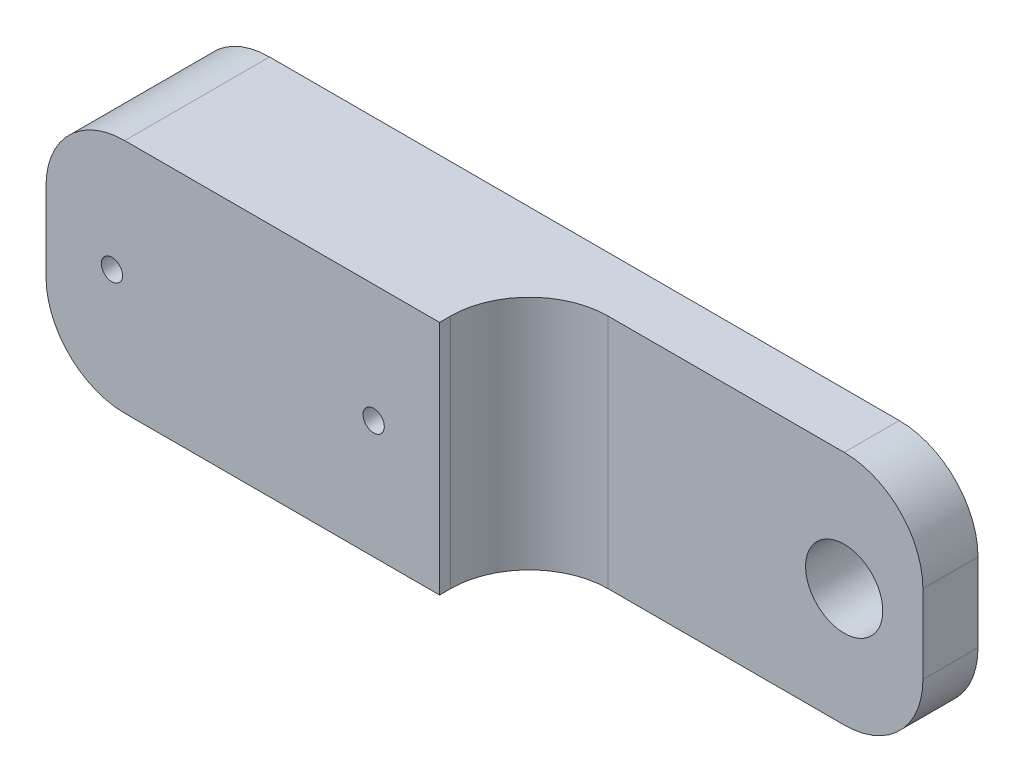
ISO-10303-21;
HEADER;
FILE_DESCRIPTION(('STEP AP214'),'2;1');
FILE_NAME('part.step','',(''),(''),'','','');
FILE_SCHEMA(('AUTOMOTIVE_DESIGN { 1 0 10303 214 1 1 1 1 }'));
ENDSEC;
DATA;
#1=APPLICATION_CONTEXT('core data for automotive mechanical design processes');
#2=APPLICATION_PROTOCOL_DEFINITION('international standard','automotive_design',2000,#1);
#3=PRODUCT_CONTEXT('',#1,'mechanical');
#4=PRODUCT('Part','Part','',(#3));
#5=PRODUCT_RELATED_PRODUCT_CATEGORY('part','',(#4));
#6=PRODUCT_DEFINITION_FORMATION('','',#4);
#7=PRODUCT_DEFINITION_CONTEXT('part definition',#1,'design');
#8=PRODUCT_DEFINITION('design','',#6,#7);
#9=PRODUCT_DEFINITION_SHAPE('','',#8);
#10=(LENGTH_UNIT() NAMED_UNIT(*) SI_UNIT(.MILLI.,.METRE.));
#11=(NAMED_UNIT(*) PLANE_ANGLE_UNIT() SI_UNIT($,.RADIAN.));
#12=(NAMED_UNIT(*) SI_UNIT($,.STERADIAN.) SOLID_ANGLE_UNIT());
#13=UNCERTAINTY_MEASURE_WITH_UNIT(LENGTH_MEASURE(1.E-05),#10,'distance_accuracy_value','');
#14=(GEOMETRIC_REPRESENTATION_CONTEXT(3) GLOBAL_UNCERTAINTY_ASSIGNED_CONTEXT((#13)) GLOBAL_UNIT_ASSIGNED_CONTEXT((#10,
#11,#12)) REPRESENTATION_CONTEXT('',''));
#15=CARTESIAN_POINT('',(0.,0.,0.));
#16=DIRECTION('',(0.,0.,1.));
#17=DIRECTION('',(1.,0.,0.));
#18=AXIS2_PLACEMENT_3D('',#15,#16,#17);
#19=CARTESIAN_POINT('',(0.,30.,18.4));
#20=DIRECTION('',(0.,1.,0.));
#21=DIRECTION('',(0.,0.,1.));
#22=AXIS2_PLACEMENT_3D('',#19,#20,#21);
#23=PLANE('',#22);
#24=DIRECTION('',(1.,0.,0.));
#25=VECTOR('',#24,1.);
#26=CARTESIAN_POINT('',(0.,30.,0.));
#27=LINE('',#26,#25);
#28=CARTESIAN_POINT('',(10.,30.,0.));
#29=VERTEX_POINT('',#28);
#30=CARTESIAN_POINT('',(90.,30.,0.));
#31=VERTEX_POINT('',#30);
#32=EDGE_CURVE('E154',#29,#31,#27,.T.);
#33=ORIENTED_EDGE('',*,*,#32,.F.);
#34=DIRECTION('',(0.,0.,-1.));
#35=VECTOR('',#34,1.);
#36=CARTESIAN_POINT('',(10.,30.,18.4));
#37=LINE('',#36,#35);
#38=CARTESIAN_POINT('',(10.,30.,18.4));
#39=VERTEX_POINT('',#38);
#40=EDGE_CURVE('E188',#29,#39,#37,.F.);
#41=ORIENTED_EDGE('',*,*,#40,.T.);
#42=DIRECTION('',(1.,0.,0.));
#43=VECTOR('',#42,1.);
#44=CARTESIAN_POINT('',(0.,30.,18.4));
#45=LINE('',#44,#43);
#46=CARTESIAN_POINT('',(50.,30.,18.4));
#47=VERTEX_POINT('',#46);
#48=EDGE_CURVE('E163',#39,#47,#45,.T.);
#49=ORIENTED_EDGE('',*,*,#48,.T.);
#50=DIRECTION('',(0.,0.,-1.));
#51=VECTOR('',#50,1.);
#52=CARTESIAN_POINT('',(50.,30.,18.4));
#53=LINE('',#52,#51);
#54=CARTESIAN_POINT('',(50.,30.,17.));
#55=VERTEX_POINT('',#54);
#56=EDGE_CURVE('E146',#47,#55,#53,.T.);
#57=ORIENTED_EDGE('',*,*,#56,.T.);
#58=CARTESIAN_POINT('',(60.,30.,17.));
#59=DIRECTION('',(0.,1.,0.));
#60=DIRECTION('',(0.,0.,1.));
#61=AXIS2_PLACEMENT_3D('',#58,#59,#60);
#62=CIRCLE('',#61,10.);
#63=CARTESIAN_POINT('',(60.,30.,7.));
#64=VERTEX_POINT('',#63);
#65=EDGE_CURVE('E46',#55,#64,#62,.F.);
#66=ORIENTED_EDGE('',*,*,#65,.T.);
#67=DIRECTION('',(1.,0.,0.));
#68=VECTOR('',#67,1.);
#69=CARTESIAN_POINT('',(0.,30.,7.));
#70=LINE('',#69,#68);
#71=CARTESIAN_POINT('',(90.,30.,7.));
#72=VERTEX_POINT('',#71);
#73=EDGE_CURVE('E158',#64,#72,#70,.T.);
#74=ORIENTED_EDGE('',*,*,#73,.T.);
#75=DIRECTION('',(0.,0.,-1.));
#76=VECTOR('',#75,1.);
#77=CARTESIAN_POINT('',(90.,30.,0.));
#78=LINE('',#77,#76);
#79=EDGE_CURVE('E185',#72,#31,#78,.T.);
#80=ORIENTED_EDGE('',*,*,#79,.T.);
#81=EDGE_LOOP('',(#33,#41,#49,#57,#66,#74,#80));
#82=FACE_BOUND('',#81,.T.);
#83=ADVANCED_FACE('F38',(#82),#23,.T.);
#84=CARTESIAN_POINT('',(0.,0.,18.4));
#85=DIRECTION('',(-1.,0.,0.));
#86=DIRECTION('',(0.,0.,1.));
#87=AXIS2_PLACEMENT_3D('',#84,#85,#86);
#88=PLANE('',#87);
#89=DIRECTION('',(0.,1.,0.));
#90=VECTOR('',#89,1.);
#91=CARTESIAN_POINT('',(0.,0.,18.4));
#92=LINE('',#91,#90);
#93=CARTESIAN_POINT('',(0.,10.,18.4));
#94=VERTEX_POINT('',#93);
#95=CARTESIAN_POINT('',(0.,20.,18.4));
#96=VERTEX_POINT('',#95);
#97=EDGE_CURVE('E135',#94,#96,#92,.T.);
#98=ORIENTED_EDGE('',*,*,#97,.T.);
#99=DIRECTION('',(0.,0.,-1.));
#100=VECTOR('',#99,1.);
#101=CARTESIAN_POINT('',(0.,20.,18.4));
#102=LINE('',#101,#100);
#103=CARTESIAN_POINT('',(0.,20.,0.));
#104=VERTEX_POINT('',#103);
#105=EDGE_CURVE('E174',#96,#104,#102,.T.);
#106=ORIENTED_EDGE('',*,*,#105,.T.);
#107=DIRECTION('',(0.,1.,0.));
#108=VECTOR('',#107,1.);
#109=CARTESIAN_POINT('',(0.,0.,0.));
#110=LINE('',#109,#108);
#111=CARTESIAN_POINT('',(0.,10.,0.));
#112=VERTEX_POINT('',#111);
#113=EDGE_CURVE('E157',#112,#104,#110,.T.);
#114=ORIENTED_EDGE('',*,*,#113,.F.);
#115=DIRECTION('',(0.,0.,-1.));
#116=VECTOR('',#115,1.);
#117=CARTESIAN_POINT('',(0.,10.,18.4));
#118=LINE('',#117,#116);
#119=EDGE_CURVE('E145',#112,#94,#118,.F.);
#120=ORIENTED_EDGE('',*,*,#119,.T.);
#121=EDGE_LOOP('',(#98,#106,#114,#120));
#122=FACE_BOUND('',#121,.T.);
#123=ADVANCED_FACE('F226',(#122),#88,.T.);
#124=CARTESIAN_POINT('',(0.,0.,18.4));
#125=DIRECTION('',(0.,1.,0.));
#126=DIRECTION('',(0.,0.,1.));
#127=AXIS2_PLACEMENT_3D('',#124,#125,#126);
#128=PLANE('',#127);
#129=DIRECTION('',(1.,0.,0.));
#130=VECTOR('',#129,1.);
#131=CARTESIAN_POINT('',(0.,0.,18.4));
#132=LINE('',#131,#130);
#133=CARTESIAN_POINT('',(10.,0.,18.4));
#134=VERTEX_POINT('',#133);
#135=CARTESIAN_POINT('',(50.,0.,18.4));
#136=VERTEX_POINT('',#135);
#137=EDGE_CURVE('E122',#134,#136,#132,.T.);
#138=ORIENTED_EDGE('',*,*,#137,.F.);
#139=DIRECTION('',(0.,0.,-1.));
#140=VECTOR('',#139,1.);
#141=CARTESIAN_POINT('',(10.,0.,0.));
#142=LINE('',#141,#140);
#143=CARTESIAN_POINT('',(10.,0.,0.));
#144=VERTEX_POINT('',#143);
#145=EDGE_CURVE('E195',#134,#144,#142,.T.);
#146=ORIENTED_EDGE('',*,*,#145,.T.);
#147=DIRECTION('',(1.,0.,0.));
#148=VECTOR('',#147,1.);
#149=CARTESIAN_POINT('',(0.,0.,0.));
#150=LINE('',#149,#148);
#151=CARTESIAN_POINT('',(90.,0.,0.));
#152=VERTEX_POINT('',#151);
#153=EDGE_CURVE('E161',#144,#152,#150,.T.);
#154=ORIENTED_EDGE('',*,*,#153,.T.);
#155=DIRECTION('',(0.,0.,-1.));
#156=VECTOR('',#155,1.);
#157=CARTESIAN_POINT('',(90.,0.,18.4));
#158=LINE('',#157,#156);
#159=CARTESIAN_POINT('',(90.,0.,7.));
#160=VERTEX_POINT('',#159);
#161=EDGE_CURVE('E193',#152,#160,#158,.F.);
#162=ORIENTED_EDGE('',*,*,#161,.T.);
#163=DIRECTION('',(1.,0.,0.));
#164=VECTOR('',#163,1.);
#165=CARTESIAN_POINT('',(0.,0.,7.));
#166=LINE('',#165,#164);
#167=CARTESIAN_POINT('',(60.,0.,7.));
#168=VERTEX_POINT('',#167);
#169=EDGE_CURVE('E266',#168,#160,#166,.T.);
#170=ORIENTED_EDGE('',*,*,#169,.F.);
#171=CARTESIAN_POINT('',(60.,0.,17.));
#172=DIRECTION('',(0.,1.,0.));
#173=DIRECTION('',(0.,0.,1.));
#174=AXIS2_PLACEMENT_3D('',#171,#172,#173);
#175=CIRCLE('',#174,10.);
#176=CARTESIAN_POINT('',(50.,0.,17.));
#177=VERTEX_POINT('',#176);
#178=EDGE_CURVE('E11',#168,#177,#175,.T.);
#179=ORIENTED_EDGE('',*,*,#178,.T.);
#180=DIRECTION('',(0.,0.,-1.));
#181=VECTOR('',#180,1.);
#182=CARTESIAN_POINT('',(50.,0.,18.4));
#183=LINE('',#182,#181);
#184=EDGE_CURVE('E138',#136,#177,#183,.T.);
#185=ORIENTED_EDGE('',*,*,#184,.F.);
#186=EDGE_LOOP('',(#138,#146,#154,#162,#170,#179,#185));
#187=FACE_BOUND('',#186,.T.);
#188=ADVANCED_FACE('F139',(#187),#128,.F.);
#189=CARTESIAN_POINT('',(50.,0.,18.4));
#190=DIRECTION('',(-1.,0.,0.));
#191=DIRECTION('',(0.,0.,1.));
#192=AXIS2_PLACEMENT_3D('',#189,#190,#191);
#193=PLANE('',#192);
#194=ORIENTED_EDGE('',*,*,#184,.T.);
#195=DIRECTION('',(0.,1.,0.));
#196=VECTOR('',#195,1.);
#197=CARTESIAN_POINT('',(50.,0.,17.));
#198=LINE('',#197,#196);
#199=EDGE_CURVE('E206',#177,#55,#198,.T.);
#200=ORIENTED_EDGE('',*,*,#199,.T.);
#201=ORIENTED_EDGE('',*,*,#56,.F.);
#202=DIRECTION('',(0.,1.,0.));
#203=VECTOR('',#202,1.);
#204=CARTESIAN_POINT('',(50.,0.,18.4));
#205=LINE('',#204,#203);
#206=EDGE_CURVE('E127',#136,#47,#205,.T.);
#207=ORIENTED_EDGE('',*,*,#206,.F.);
#208=EDGE_LOOP('',(#194,#200,#201,#207));
#209=FACE_BOUND('',#208,.T.);
#210=ADVANCED_FACE('F148',(#209),#193,.F.);
#211=CARTESIAN_POINT('',(0.,0.,18.4));
#212=DIRECTION('',(0.,0.,1.));
#213=DIRECTION('',(1.,0.,0.));
#214=AXIS2_PLACEMENT_3D('',#211,#212,#213);
#215=PLANE('',#214);
#216=CARTESIAN_POINT('',(8.375,15.,18.4));
#217=DIRECTION('',(0.,0.,1.));
#218=DIRECTION('',(1.,0.,0.));
#219=AXIS2_PLACEMENT_3D('',#216,#217,#218);
#220=CIRCLE('',#219,1.35);
#221=CARTESIAN_POINT('',(9.725,15.,18.4));
#222=VERTEX_POINT('',#221);
#223=EDGE_CURVE('E169',#222,#222,#220,.T.);
#224=ORIENTED_EDGE('',*,*,#223,.F.);
#225=EDGE_LOOP('',(#224));
#226=FACE_BOUND('',#225,.T.);
#227=CARTESIAN_POINT('',(41.625,15.,18.4));
#228=DIRECTION('',(0.,0.,1.));
#229=DIRECTION('',(1.,0.,0.));
#230=AXIS2_PLACEMENT_3D('',#227,#228,#229);
#231=CIRCLE('',#230,1.35);
#232=CARTESIAN_POINT('',(42.975,15.,18.4));
#233=VERTEX_POINT('',#232);
#234=EDGE_CURVE('E270',#233,#233,#231,.T.);
#235=ORIENTED_EDGE('',*,*,#234,.F.);
#236=EDGE_LOOP('',(#235));
#237=FACE_BOUND('',#236,.T.);
#238=ORIENTED_EDGE('',*,*,#48,.F.);
#239=CARTESIAN_POINT('',(10.,20.,18.4));
#240=DIRECTION('',(0.,0.,1.));
#241=DIRECTION('',(1.,0.,0.));
#242=AXIS2_PLACEMENT_3D('',#239,#240,#241);
#243=CIRCLE('',#242,10.);
#244=EDGE_CURVE('E191',#39,#96,#243,.T.);
#245=ORIENTED_EDGE('',*,*,#244,.T.);
#246=ORIENTED_EDGE('',*,*,#97,.F.);
#247=CARTESIAN_POINT('',(10.,10.,18.4));
#248=DIRECTION('',(0.,0.,1.));
#249=DIRECTION('',(1.,0.,0.));
#250=AXIS2_PLACEMENT_3D('',#247,#248,#249);
#251=CIRCLE('',#250,10.);
#252=EDGE_CURVE('E131',#94,#134,#251,.T.);
#253=ORIENTED_EDGE('',*,*,#252,.T.);
#254=ORIENTED_EDGE('',*,*,#137,.T.);
#255=ORIENTED_EDGE('',*,*,#206,.T.);
#256=EDGE_LOOP('',(#238,#245,#246,#253,#254,#255));
#257=FACE_BOUND('',#256,.T.);
#258=ADVANCED_FACE('F125',(#226,#237,#257),#215,.T.);
#259=CARTESIAN_POINT('',(0.,0.,0.));
#260=DIRECTION('',(0.,0.,1.));
#261=DIRECTION('',(1.,0.,0.));
#262=AXIS2_PLACEMENT_3D('',#259,#260,#261);
#263=PLANE('',#262);
#264=CARTESIAN_POINT('',(8.375,15.,0.));
#265=DIRECTION('',(0.,0.,1.));
#266=DIRECTION('',(1.,0.,0.));
#267=AXIS2_PLACEMENT_3D('',#264,#265,#266);
#268=CIRCLE('',#267,1.35);
#269=CARTESIAN_POINT('',(9.725,15.,0.));
#270=VERTEX_POINT('',#269);
#271=EDGE_CURVE('E168',#270,#270,#268,.T.);
#272=ORIENTED_EDGE('',*,*,#271,.T.);
#273=EDGE_LOOP('',(#272));
#274=FACE_BOUND('',#273,.T.);
#275=CARTESIAN_POINT('',(41.625,15.,0.));
#276=DIRECTION('',(0.,0.,1.));
#277=DIRECTION('',(1.,0.,0.));
#278=AXIS2_PLACEMENT_3D('',#275,#276,#277);
#279=CIRCLE('',#278,1.35);
#280=CARTESIAN_POINT('',(42.975,15.,0.));
#281=VERTEX_POINT('',#280);
#282=EDGE_CURVE('E165',#281,#281,#279,.T.);
#283=ORIENTED_EDGE('',*,*,#282,.T.);
#284=EDGE_LOOP('',(#283));
#285=FACE_BOUND('',#284,.T.);
#286=ORIENTED_EDGE('',*,*,#113,.T.);
#287=CARTESIAN_POINT('',(10.,20.,0.));
#288=DIRECTION('',(0.,0.,1.));
#289=DIRECTION('',(1.,0.,0.));
#290=AXIS2_PLACEMENT_3D('',#287,#288,#289);
#291=CIRCLE('',#290,10.);
#292=EDGE_CURVE('E183',#104,#29,#291,.F.);
#293=ORIENTED_EDGE('',*,*,#292,.T.);
#294=ORIENTED_EDGE('',*,*,#32,.T.);
#295=CARTESIAN_POINT('',(90.,20.,0.));
#296=DIRECTION('',(0.,0.,1.));
#297=DIRECTION('',(1.,0.,0.));
#298=AXIS2_PLACEMENT_3D('',#295,#296,#297);
#299=CIRCLE('',#298,10.);
#300=CARTESIAN_POINT('',(100.,20.,0.));
#301=VERTEX_POINT('',#300);
#302=EDGE_CURVE('E179',#31,#301,#299,.F.);
#303=ORIENTED_EDGE('',*,*,#302,.T.);
#304=DIRECTION('',(0.,1.,0.));
#305=VECTOR('',#304,1.);
#306=CARTESIAN_POINT('',(100.,0.,0.));
#307=LINE('',#306,#305);
#308=CARTESIAN_POINT('',(100.,10.,0.));
#309=VERTEX_POINT('',#308);
#310=EDGE_CURVE('E260',#309,#301,#307,.T.);
#311=ORIENTED_EDGE('',*,*,#310,.F.);
#312=CARTESIAN_POINT('',(90.,10.,0.));
#313=DIRECTION('',(0.,0.,1.));
#314=DIRECTION('',(1.,0.,0.));
#315=AXIS2_PLACEMENT_3D('',#312,#313,#314);
#316=CIRCLE('',#315,10.);
#317=EDGE_CURVE('E177',#309,#152,#316,.F.);
#318=ORIENTED_EDGE('',*,*,#317,.T.);
#319=ORIENTED_EDGE('',*,*,#153,.F.);
#320=CARTESIAN_POINT('',(10.,10.,0.));
#321=DIRECTION('',(0.,0.,1.));
#322=DIRECTION('',(1.,0.,0.));
#323=AXIS2_PLACEMENT_3D('',#320,#321,#322);
#324=CIRCLE('',#323,10.);
#325=EDGE_CURVE('E181',#144,#112,#324,.F.);
#326=ORIENTED_EDGE('',*,*,#325,.T.);
#327=EDGE_LOOP('',(#286,#293,#294,#303,#311,#318,#319,#326));
#328=FACE_BOUND('',#327,.T.);
#329=CARTESIAN_POINT('',(90.,15.,0.));
#330=DIRECTION('',(0.,0.,1.));
#331=DIRECTION('',(1.,0.,0.));
#332=AXIS2_PLACEMENT_3D('',#329,#330,#331);
#333=CIRCLE('',#332,4.9);
#334=CARTESIAN_POINT('',(94.9,15.,0.));
#335=VERTEX_POINT('',#334);
#336=EDGE_CURVE('E172',#335,#335,#333,.T.);
#337=ORIENTED_EDGE('',*,*,#336,.T.);
#338=EDGE_LOOP('',(#337));
#339=FACE_BOUND('',#338,.T.);
#340=ADVANCED_FACE('F250',(#274,#285,#328,#339),#263,.F.);
#341=CARTESIAN_POINT('',(100.,0.,7.));
#342=DIRECTION('',(-1.,0.,0.));
#343=DIRECTION('',(0.,0.,1.));
#344=AXIS2_PLACEMENT_3D('',#341,#342,#343);
#345=PLANE('',#344);
#346=ORIENTED_EDGE('',*,*,#310,.T.);
#347=DIRECTION('',(0.,0.,-1.));
#348=VECTOR('',#347,1.);
#349=CARTESIAN_POINT('',(100.,20.,7.));
#350=LINE('',#349,#348);
#351=CARTESIAN_POINT('',(100.,20.,7.));
#352=VERTEX_POINT('',#351);
#353=EDGE_CURVE('E53',#301,#352,#350,.F.);
#354=ORIENTED_EDGE('',*,*,#353,.T.);
#355=DIRECTION('',(0.,1.,0.));
#356=VECTOR('',#355,1.);
#357=CARTESIAN_POINT('',(100.,0.,7.));
#358=LINE('',#357,#356);
#359=CARTESIAN_POINT('',(100.,10.,7.));
#360=VERTEX_POINT('',#359);
#361=EDGE_CURVE('E216',#360,#352,#358,.T.);
#362=ORIENTED_EDGE('',*,*,#361,.F.);
#363=DIRECTION('',(0.,0.,-1.));
#364=VECTOR('',#363,1.);
#365=CARTESIAN_POINT('',(100.,10.,7.));
#366=LINE('',#365,#364);
#367=EDGE_CURVE('E197',#360,#309,#366,.T.);
#368=ORIENTED_EDGE('',*,*,#367,.T.);
#369=EDGE_LOOP('',(#346,#354,#362,#368));
#370=FACE_BOUND('',#369,.T.);
#371=ADVANCED_FACE('F290',(#370),#345,.F.);
#372=CARTESIAN_POINT('',(90.,15.,7.));
#373=DIRECTION('',(0.,0.,-1.));
#374=DIRECTION('',(-1.,0.,0.));
#375=AXIS2_PLACEMENT_3D('',#372,#373,#374);
#376=CYLINDRICAL_SURFACE('',#375,4.9);
#377=CARTESIAN_POINT('',(90.,15.,7.));
#378=DIRECTION('',(0.,0.,1.));
#379=DIRECTION('',(1.,0.,0.));
#380=AXIS2_PLACEMENT_3D('',#377,#378,#379);
#381=CIRCLE('',#380,4.9);
#382=CARTESIAN_POINT('',(94.9,15.,7.));
#383=VERTEX_POINT('',#382);
#384=EDGE_CURVE('E262',#383,#383,#381,.T.);
#385=ORIENTED_EDGE('',*,*,#384,.T.);
#386=EDGE_LOOP('',(#385));
#387=FACE_BOUND('',#386,.T.);
#388=ORIENTED_EDGE('',*,*,#336,.F.);
#389=EDGE_LOOP('',(#388));
#390=FACE_BOUND('',#389,.T.);
#391=ADVANCED_FACE('F296',(#387,#390),#376,.F.);
#392=CARTESIAN_POINT('',(0.,0.,7.));
#393=DIRECTION('',(0.,0.,1.));
#394=DIRECTION('',(1.,0.,0.));
#395=AXIS2_PLACEMENT_3D('',#392,#393,#394);
#396=PLANE('',#395);
#397=ORIENTED_EDGE('',*,*,#384,.F.);
#398=EDGE_LOOP('',(#397));
#399=FACE_BOUND('',#398,.T.);
#400=ORIENTED_EDGE('',*,*,#361,.T.);
#401=CARTESIAN_POINT('',(90.,20.,7.));
#402=DIRECTION('',(0.,0.,1.));
#403=DIRECTION('',(1.,0.,0.));
#404=AXIS2_PLACEMENT_3D('',#401,#402,#403);
#405=CIRCLE('',#404,10.);
#406=EDGE_CURVE('E204',#352,#72,#405,.T.);
#407=ORIENTED_EDGE('',*,*,#406,.T.);
#408=ORIENTED_EDGE('',*,*,#73,.F.);
#409=DIRECTION('',(0.,1.,0.));
#410=VECTOR('',#409,1.);
#411=CARTESIAN_POINT('',(60.,0.,7.));
#412=LINE('',#411,#410);
#413=EDGE_CURVE('E201',#64,#168,#412,.F.);
#414=ORIENTED_EDGE('',*,*,#413,.T.);
#415=ORIENTED_EDGE('',*,*,#169,.T.);
#416=CARTESIAN_POINT('',(90.,10.,7.));
#417=DIRECTION('',(0.,0.,1.));
#418=DIRECTION('',(1.,0.,0.));
#419=AXIS2_PLACEMENT_3D('',#416,#417,#418);
#420=CIRCLE('',#419,10.);
#421=EDGE_CURVE('E60',#160,#360,#420,.T.);
#422=ORIENTED_EDGE('',*,*,#421,.T.);
#423=EDGE_LOOP('',(#400,#407,#408,#414,#415,#422));
#424=FACE_BOUND('',#423,.T.);
#425=ADVANCED_FACE('F214',(#399,#424),#396,.T.);
#426=CARTESIAN_POINT('',(41.625,15.,-8.6));
#427=DIRECTION('',(0.,0.,1.));
#428=DIRECTION('',(1.,0.,0.));
#429=AXIS2_PLACEMENT_3D('',#426,#427,#428);
#430=CYLINDRICAL_SURFACE('',#429,1.35);
#431=ORIENTED_EDGE('',*,*,#234,.T.);
#432=EDGE_LOOP('',(#431));
#433=FACE_BOUND('',#432,.T.);
#434=ORIENTED_EDGE('',*,*,#282,.F.);
#435=EDGE_LOOP('',(#434));
#436=FACE_BOUND('',#435,.T.);
#437=ADVANCED_FACE('F283',(#433,#436),#430,.F.);
#438=CARTESIAN_POINT('',(8.375,15.,-8.6));
#439=DIRECTION('',(0.,0.,1.));
#440=DIRECTION('',(1.,0.,0.));
#441=AXIS2_PLACEMENT_3D('',#438,#439,#440);
#442=CYLINDRICAL_SURFACE('',#441,1.35);
#443=ORIENTED_EDGE('',*,*,#223,.T.);
#444=EDGE_LOOP('',(#443));
#445=FACE_BOUND('',#444,.T.);
#446=ORIENTED_EDGE('',*,*,#271,.F.);
#447=EDGE_LOOP('',(#446));
#448=FACE_BOUND('',#447,.T.);
#449=ADVANCED_FACE('F239',(#445,#448),#442,.F.);
#450=CARTESIAN_POINT('',(10.,20.,18.4));
#451=DIRECTION('',(0.,0.,-1.));
#452=DIRECTION('',(-1.,0.,0.));
#453=AXIS2_PLACEMENT_3D('',#450,#451,#452);
#454=CYLINDRICAL_SURFACE('',#453,10.);
#455=ORIENTED_EDGE('',*,*,#244,.F.);
#456=ORIENTED_EDGE('',*,*,#40,.F.);
#457=ORIENTED_EDGE('',*,*,#292,.F.);
#458=ORIENTED_EDGE('',*,*,#105,.F.);
#459=EDGE_LOOP('',(#455,#456,#457,#458));
#460=FACE_BOUND('',#459,.T.);
#461=ADVANCED_FACE('F235',(#460),#454,.T.);
#462=CARTESIAN_POINT('',(10.,10.,18.4));
#463=DIRECTION('',(0.,0.,1.));
#464=DIRECTION('',(1.,0.,0.));
#465=AXIS2_PLACEMENT_3D('',#462,#463,#464);
#466=CYLINDRICAL_SURFACE('',#465,10.);
#467=ORIENTED_EDGE('',*,*,#252,.F.);
#468=ORIENTED_EDGE('',*,*,#119,.F.);
#469=ORIENTED_EDGE('',*,*,#325,.F.);
#470=ORIENTED_EDGE('',*,*,#145,.F.);
#471=EDGE_LOOP('',(#467,#468,#469,#470));
#472=FACE_BOUND('',#471,.T.);
#473=ADVANCED_FACE('F238',(#472),#466,.T.);
#474=CARTESIAN_POINT('',(90.,20.,18.4));
#475=DIRECTION('',(0.,0.,1.));
#476=DIRECTION('',(1.,0.,0.));
#477=AXIS2_PLACEMENT_3D('',#474,#475,#476);
#478=CYLINDRICAL_SURFACE('',#477,10.);
#479=ORIENTED_EDGE('',*,*,#406,.F.);
#480=ORIENTED_EDGE('',*,*,#353,.F.);
#481=ORIENTED_EDGE('',*,*,#302,.F.);
#482=ORIENTED_EDGE('',*,*,#79,.F.);
#483=EDGE_LOOP('',(#479,#480,#481,#482));
#484=FACE_BOUND('',#483,.T.);
#485=ADVANCED_FACE('F223',(#484),#478,.T.);
#486=CARTESIAN_POINT('',(90.,10.,7.));
#487=DIRECTION('',(0.,0.,-1.));
#488=DIRECTION('',(-1.,0.,0.));
#489=AXIS2_PLACEMENT_3D('',#486,#487,#488);
#490=CYLINDRICAL_SURFACE('',#489,10.);
#491=ORIENTED_EDGE('',*,*,#421,.F.);
#492=ORIENTED_EDGE('',*,*,#161,.F.);
#493=ORIENTED_EDGE('',*,*,#317,.F.);
#494=ORIENTED_EDGE('',*,*,#367,.F.);
#495=EDGE_LOOP('',(#491,#492,#493,#494));
#496=FACE_BOUND('',#495,.T.);
#497=ADVANCED_FACE('F219',(#496),#490,.T.);
#498=CARTESIAN_POINT('',(60.,0.,17.));
#499=DIRECTION('',(0.,1.,0.));
#500=DIRECTION('',(0.,0.,1.));
#501=AXIS2_PLACEMENT_3D('',#498,#499,#500);
#502=CYLINDRICAL_SURFACE('',#501,10.);
#503=ORIENTED_EDGE('',*,*,#178,.F.);
#504=ORIENTED_EDGE('',*,*,#413,.F.);
#505=ORIENTED_EDGE('',*,*,#65,.F.);
#506=ORIENTED_EDGE('',*,*,#199,.F.);
#507=EDGE_LOOP('',(#503,#504,#505,#506));
#508=FACE_BOUND('',#507,.T.);
#509=ADVANCED_FACE('F40',(#508),#502,.F.);
#510=CLOSED_SHELL('',(#83,#123,#188,#210,#258,#340,#371,#391,#425,#437,#449,#461,#473,#485,#497,#509));
#511=MANIFOLD_SOLID_BREP('B2',#510);
#512=ADVANCED_BREP_SHAPE_REPRESENTATION('',(#18,#511),#14);
#513=SHAPE_DEFINITION_REPRESENTATION(#9,#512);
ENDSEC;
END-ISO-10303-21;
